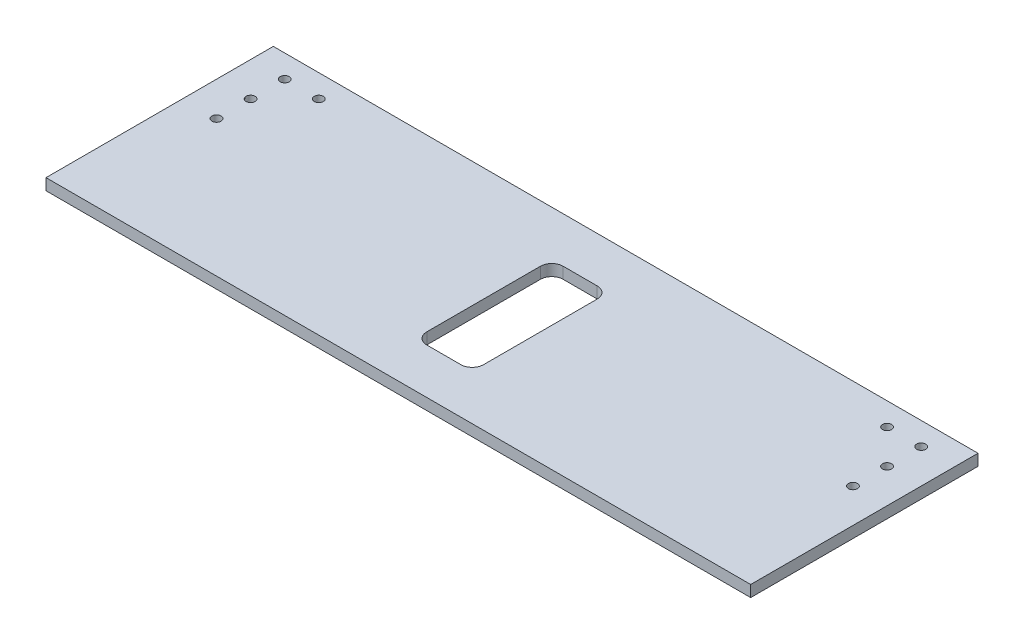
ISO-10303-21;
HEADER;
FILE_DESCRIPTION(('STEP AP214'),'2;1');
FILE_NAME('part.step','',(''),(''),'','','');
FILE_SCHEMA(('AUTOMOTIVE_DESIGN { 1 0 10303 214 1 1 1 1 }'));
ENDSEC;
DATA;
#1=APPLICATION_CONTEXT('core data for automotive mechanical design processes');
#2=APPLICATION_PROTOCOL_DEFINITION('international standard','automotive_design',2000,#1);
#3=PRODUCT_CONTEXT('',#1,'mechanical');
#4=PRODUCT('Part','Part','',(#3));
#5=PRODUCT_RELATED_PRODUCT_CATEGORY('part','',(#4));
#6=PRODUCT_DEFINITION_FORMATION('','',#4);
#7=PRODUCT_DEFINITION_CONTEXT('part definition',#1,'design');
#8=PRODUCT_DEFINITION('design','',#6,#7);
#9=PRODUCT_DEFINITION_SHAPE('','',#8);
#10=(LENGTH_UNIT() NAMED_UNIT(*) SI_UNIT(.MILLI.,.METRE.));
#11=(NAMED_UNIT(*) PLANE_ANGLE_UNIT() SI_UNIT($,.RADIAN.));
#12=(NAMED_UNIT(*) SI_UNIT($,.STERADIAN.) SOLID_ANGLE_UNIT());
#13=UNCERTAINTY_MEASURE_WITH_UNIT(LENGTH_MEASURE(1.E-05),#10,'distance_accuracy_value','');
#14=(GEOMETRIC_REPRESENTATION_CONTEXT(3) GLOBAL_UNCERTAINTY_ASSIGNED_CONTEXT((#13)) GLOBAL_UNIT_ASSIGNED_CONTEXT((#10,
#11,#12)) REPRESENTATION_CONTEXT('',''));
#15=CARTESIAN_POINT('',(0.,0.,0.));
#16=DIRECTION('',(0.,0.,1.));
#17=DIRECTION('',(1.,0.,0.));
#18=AXIS2_PLACEMENT_3D('',#15,#16,#17);
#19=CARTESIAN_POINT('',(-155.,5.,0.));
#20=DIRECTION('',(1.,0.,0.));
#21=DIRECTION('',(0.,0.,-1.));
#22=AXIS2_PLACEMENT_3D('',#19,#20,#21);
#23=PLANE('',#22);
#24=DIRECTION('',(0.,0.,1.));
#25=VECTOR('',#24,1.);
#26=CARTESIAN_POINT('',(-155.,5.,0.));
#27=LINE('',#26,#25);
#28=CARTESIAN_POINT('',(-155.,5.,-50.));
#29=VERTEX_POINT('',#28);
#30=CARTESIAN_POINT('',(-155.,5.,50.));
#31=VERTEX_POINT('',#30);
#32=EDGE_CURVE('E150',#29,#31,#27,.T.);
#33=ORIENTED_EDGE('',*,*,#32,.F.);
#34=DIRECTION('',(0.,1.,0.));
#35=VECTOR('',#34,1.);
#36=CARTESIAN_POINT('',(-155.,0.,-50.));
#37=LINE('',#36,#35);
#38=CARTESIAN_POINT('',(-155.,0.,-50.));
#39=VERTEX_POINT('',#38);
#40=EDGE_CURVE('E136',#39,#29,#37,.T.);
#41=ORIENTED_EDGE('',*,*,#40,.F.);
#42=DIRECTION('',(0.,0.,1.));
#43=VECTOR('',#42,1.);
#44=CARTESIAN_POINT('',(-155.,0.,0.));
#45=LINE('',#44,#43);
#46=CARTESIAN_POINT('',(-155.,0.,50.));
#47=VERTEX_POINT('',#46);
#48=EDGE_CURVE('E148',#39,#47,#45,.T.);
#49=ORIENTED_EDGE('',*,*,#48,.T.);
#50=DIRECTION('',(0.,-1.,0.));
#51=VECTOR('',#50,1.);
#52=CARTESIAN_POINT('',(-155.,5.,50.));
#53=LINE('',#52,#51);
#54=EDGE_CURVE('E172',#31,#47,#53,.T.);
#55=ORIENTED_EDGE('',*,*,#54,.F.);
#56=EDGE_LOOP('',(#33,#41,#49,#55));
#57=FACE_BOUND('',#56,.T.);
#58=ADVANCED_FACE('F43',(#57),#23,.F.);
#59=CARTESIAN_POINT('',(0.,5.,50.));
#60=DIRECTION('',(0.,0.,-1.));
#61=DIRECTION('',(-1.,0.,0.));
#62=AXIS2_PLACEMENT_3D('',#59,#60,#61);
#63=PLANE('',#62);
#64=DIRECTION('',(1.,0.,0.));
#65=VECTOR('',#64,1.);
#66=CARTESIAN_POINT('',(0.,0.,50.));
#67=LINE('',#66,#65);
#68=CARTESIAN_POINT('',(155.,0.,50.));
#69=VERTEX_POINT('',#68);
#70=EDGE_CURVE('E156',#47,#69,#67,.T.);
#71=ORIENTED_EDGE('',*,*,#70,.T.);
#72=DIRECTION('',(0.,-1.,0.));
#73=VECTOR('',#72,1.);
#74=CARTESIAN_POINT('',(155.,5.,50.));
#75=LINE('',#74,#73);
#76=CARTESIAN_POINT('',(155.,5.,50.));
#77=VERTEX_POINT('',#76);
#78=EDGE_CURVE('E169',#77,#69,#75,.T.);
#79=ORIENTED_EDGE('',*,*,#78,.F.);
#80=DIRECTION('',(1.,0.,0.));
#81=VECTOR('',#80,1.);
#82=CARTESIAN_POINT('',(0.,5.,50.));
#83=LINE('',#82,#81);
#84=EDGE_CURVE('E259',#31,#77,#83,.T.);
#85=ORIENTED_EDGE('',*,*,#84,.F.);
#86=ORIENTED_EDGE('',*,*,#54,.T.);
#87=EDGE_LOOP('',(#71,#79,#85,#86));
#88=FACE_BOUND('',#87,.T.);
#89=ADVANCED_FACE('F396',(#88),#63,.F.);
#90=CARTESIAN_POINT('',(155.,5.,0.));
#91=DIRECTION('',(1.,0.,0.));
#92=DIRECTION('',(0.,0.,-1.));
#93=AXIS2_PLACEMENT_3D('',#90,#91,#92);
#94=PLANE('',#93);
#95=DIRECTION('',(0.,1.,0.));
#96=VECTOR('',#95,1.);
#97=CARTESIAN_POINT('',(155.,0.,-50.));
#98=LINE('',#97,#96);
#99=CARTESIAN_POINT('',(155.,0.,-50.));
#100=VERTEX_POINT('',#99);
#101=CARTESIAN_POINT('',(155.,5.,-50.));
#102=VERTEX_POINT('',#101);
#103=EDGE_CURVE('E139',#100,#102,#98,.T.);
#104=ORIENTED_EDGE('',*,*,#103,.T.);
#105=DIRECTION('',(0.,0.,1.));
#106=VECTOR('',#105,1.);
#107=CARTESIAN_POINT('',(155.,5.,0.));
#108=LINE('',#107,#106);
#109=EDGE_CURVE('E164',#102,#77,#108,.T.);
#110=ORIENTED_EDGE('',*,*,#109,.T.);
#111=ORIENTED_EDGE('',*,*,#78,.T.);
#112=DIRECTION('',(0.,0.,1.));
#113=VECTOR('',#112,1.);
#114=CARTESIAN_POINT('',(155.,0.,0.));
#115=LINE('',#114,#113);
#116=EDGE_CURVE('E159',#100,#69,#115,.T.);
#117=ORIENTED_EDGE('',*,*,#116,.F.);
#118=EDGE_LOOP('',(#104,#110,#111,#117));
#119=FACE_BOUND('',#118,.T.);
#120=ADVANCED_FACE('F365',(#119),#94,.T.);
#121=CARTESIAN_POINT('',(0.,5.,0.));
#122=DIRECTION('',(0.,1.,0.));
#123=DIRECTION('',(0.,0.,1.));
#124=AXIS2_PLACEMENT_3D('',#121,#122,#123);
#125=PLANE('',#124);
#126=DIRECTION('',(1.,0.,0.));
#127=VECTOR('',#126,1.);
#128=CARTESIAN_POINT('',(-40.,5.,-50.));
#129=LINE('',#128,#127);
#130=EDGE_CURVE('E144',#29,#102,#129,.T.);
#131=ORIENTED_EDGE('',*,*,#130,.F.);
#132=ORIENTED_EDGE('',*,*,#32,.T.);
#133=ORIENTED_EDGE('',*,*,#84,.T.);
#134=ORIENTED_EDGE('',*,*,#109,.F.);
#135=EDGE_LOOP('',(#131,#132,#133,#134));
#136=FACE_BOUND('',#135,.T.);
#137=CARTESIAN_POINT('',(140.,5.,-40.));
#138=DIRECTION('',(0.,1.,0.));
#139=DIRECTION('',(0.,0.,-1.));
#140=AXIS2_PLACEMENT_3D('',#137,#138,#139);
#141=CIRCLE('',#140,2.);
#142=CARTESIAN_POINT('',(140.,5.,-42.));
#143=VERTEX_POINT('',#142);
#144=EDGE_CURVE('E143',#143,#143,#141,.T.);
#145=ORIENTED_EDGE('',*,*,#144,.F.);
#146=EDGE_LOOP('',(#145));
#147=FACE_BOUND('',#146,.T.);
#148=CARTESIAN_POINT('',(125.,5.,-40.));
#149=DIRECTION('',(0.,1.,0.));
#150=DIRECTION('',(0.,0.,-1.));
#151=AXIS2_PLACEMENT_3D('',#148,#149,#150);
#152=CIRCLE('',#151,2.);
#153=CARTESIAN_POINT('',(125.,5.,-42.));
#154=VERTEX_POINT('',#153);
#155=EDGE_CURVE('E321',#154,#154,#152,.T.);
#156=ORIENTED_EDGE('',*,*,#155,.F.);
#157=EDGE_LOOP('',(#156));
#158=FACE_BOUND('',#157,.T.);
#159=CARTESIAN_POINT('',(140.,5.,-25.));
#160=DIRECTION('',(0.,1.,0.));
#161=DIRECTION('',(0.,0.,-1.));
#162=AXIS2_PLACEMENT_3D('',#159,#160,#161);
#163=CIRCLE('',#162,2.);
#164=CARTESIAN_POINT('',(140.,5.,-27.));
#165=VERTEX_POINT('',#164);
#166=EDGE_CURVE('E316',#165,#165,#163,.T.);
#167=ORIENTED_EDGE('',*,*,#166,.F.);
#168=EDGE_LOOP('',(#167));
#169=FACE_BOUND('',#168,.T.);
#170=CARTESIAN_POINT('',(140.,5.,-10.));
#171=DIRECTION('',(0.,1.,0.));
#172=DIRECTION('',(0.,0.,-1.));
#173=AXIS2_PLACEMENT_3D('',#170,#171,#172);
#174=CIRCLE('',#173,2.);
#175=CARTESIAN_POINT('',(140.,5.,-12.));
#176=VERTEX_POINT('',#175);
#177=EDGE_CURVE('E311',#176,#176,#174,.T.);
#178=ORIENTED_EDGE('',*,*,#177,.F.);
#179=EDGE_LOOP('',(#178));
#180=FACE_BOUND('',#179,.T.);
#181=CARTESIAN_POINT('',(-140.,5.,-10.));
#182=DIRECTION('',(0.,1.,0.));
#183=DIRECTION('',(0.,0.,1.));
#184=AXIS2_PLACEMENT_3D('',#181,#182,#183);
#185=CIRCLE('',#184,2.);
#186=CARTESIAN_POINT('',(-140.,5.,-8.00000000000001));
#187=VERTEX_POINT('',#186);
#188=EDGE_CURVE('E306',#187,#187,#185,.T.);
#189=ORIENTED_EDGE('',*,*,#188,.F.);
#190=EDGE_LOOP('',(#189));
#191=FACE_BOUND('',#190,.T.);
#192=CARTESIAN_POINT('',(-140.,5.,-25.));
#193=DIRECTION('',(0.,1.,0.));
#194=DIRECTION('',(0.,0.,1.));
#195=AXIS2_PLACEMENT_3D('',#192,#193,#194);
#196=CIRCLE('',#195,2.);
#197=CARTESIAN_POINT('',(-140.,5.,-23.));
#198=VERTEX_POINT('',#197);
#199=EDGE_CURVE('E301',#198,#198,#196,.T.);
#200=ORIENTED_EDGE('',*,*,#199,.F.);
#201=EDGE_LOOP('',(#200));
#202=FACE_BOUND('',#201,.T.);
#203=CARTESIAN_POINT('',(-125.,5.,-40.));
#204=DIRECTION('',(0.,1.,0.));
#205=DIRECTION('',(0.,0.,1.));
#206=AXIS2_PLACEMENT_3D('',#203,#204,#205);
#207=CIRCLE('',#206,2.);
#208=CARTESIAN_POINT('',(-125.,5.,-38.));
#209=VERTEX_POINT('',#208);
#210=EDGE_CURVE('E296',#209,#209,#207,.T.);
#211=ORIENTED_EDGE('',*,*,#210,.F.);
#212=EDGE_LOOP('',(#211));
#213=FACE_BOUND('',#212,.T.);
#214=CARTESIAN_POINT('',(-140.,5.,-40.));
#215=DIRECTION('',(0.,1.,0.));
#216=DIRECTION('',(0.,0.,1.));
#217=AXIS2_PLACEMENT_3D('',#214,#215,#216);
#218=CIRCLE('',#217,2.);
#219=CARTESIAN_POINT('',(-140.,5.,-38.));
#220=VERTEX_POINT('',#219);
#221=EDGE_CURVE('E292',#220,#220,#218,.T.);
#222=ORIENTED_EDGE('',*,*,#221,.F.);
#223=EDGE_LOOP('',(#222));
#224=FACE_BOUND('',#223,.T.);
#225=DIRECTION('',(0.,0.,-1.));
#226=VECTOR('',#225,1.);
#227=CARTESIAN_POINT('',(12.5,5.,30.));
#228=LINE('',#227,#226);
#229=CARTESIAN_POINT('',(12.5,5.,25.));
#230=VERTEX_POINT('',#229);
#231=CARTESIAN_POINT('',(12.5,5.,-25.));
#232=VERTEX_POINT('',#231);
#233=EDGE_CURVE('E226',#230,#232,#228,.T.);
#234=ORIENTED_EDGE('',*,*,#233,.F.);
#235=CARTESIAN_POINT('',(7.5,5.,25.));
#236=DIRECTION('',(0.,1.,0.));
#237=DIRECTION('',(0.,0.,1.));
#238=AXIS2_PLACEMENT_3D('',#235,#236,#237);
#239=CIRCLE('',#238,5.);
#240=CARTESIAN_POINT('',(7.5,5.,30.));
#241=VERTEX_POINT('',#240);
#242=EDGE_CURVE('E203',#230,#241,#239,.F.);
#243=ORIENTED_EDGE('',*,*,#242,.T.);
#244=DIRECTION('',(1.,0.,0.));
#245=VECTOR('',#244,1.);
#246=CARTESIAN_POINT('',(-12.5,5.,30.));
#247=LINE('',#246,#245);
#248=CARTESIAN_POINT('',(-7.5,5.,30.));
#249=VERTEX_POINT('',#248);
#250=EDGE_CURVE('E251',#249,#241,#247,.T.);
#251=ORIENTED_EDGE('',*,*,#250,.F.);
#252=CARTESIAN_POINT('',(-7.5,5.,25.));
#253=DIRECTION('',(0.,1.,0.));
#254=DIRECTION('',(0.,0.,1.));
#255=AXIS2_PLACEMENT_3D('',#252,#253,#254);
#256=CIRCLE('',#255,5.);
#257=CARTESIAN_POINT('',(-12.5,5.,25.));
#258=VERTEX_POINT('',#257);
#259=EDGE_CURVE('E193',#249,#258,#256,.F.);
#260=ORIENTED_EDGE('',*,*,#259,.T.);
#261=DIRECTION('',(0.,0.,1.));
#262=VECTOR('',#261,1.);
#263=CARTESIAN_POINT('',(-12.5,5.,30.));
#264=LINE('',#263,#262);
#265=CARTESIAN_POINT('',(-12.5,5.,-25.));
#266=VERTEX_POINT('',#265);
#267=EDGE_CURVE('E217',#266,#258,#264,.T.);
#268=ORIENTED_EDGE('',*,*,#267,.F.);
#269=CARTESIAN_POINT('',(-7.5,5.,-25.));
#270=DIRECTION('',(0.,1.,0.));
#271=DIRECTION('',(0.,0.,1.));
#272=AXIS2_PLACEMENT_3D('',#269,#270,#271);
#273=CIRCLE('',#272,5.);
#274=CARTESIAN_POINT('',(-7.5,5.,-30.));
#275=VERTEX_POINT('',#274);
#276=EDGE_CURVE('E51',#266,#275,#273,.F.);
#277=ORIENTED_EDGE('',*,*,#276,.T.);
#278=DIRECTION('',(-1.,0.,0.));
#279=VECTOR('',#278,1.);
#280=CARTESIAN_POINT('',(-12.5,5.,-30.));
#281=LINE('',#280,#279);
#282=CARTESIAN_POINT('',(7.5,5.,-30.));
#283=VERTEX_POINT('',#282);
#284=EDGE_CURVE('E215',#283,#275,#281,.T.);
#285=ORIENTED_EDGE('',*,*,#284,.F.);
#286=CARTESIAN_POINT('',(7.5,5.,-25.));
#287=DIRECTION('',(0.,1.,0.));
#288=DIRECTION('',(0.,0.,1.));
#289=AXIS2_PLACEMENT_3D('',#286,#287,#288);
#290=CIRCLE('',#289,5.);
#291=EDGE_CURVE('E198',#283,#232,#290,.F.);
#292=ORIENTED_EDGE('',*,*,#291,.T.);
#293=EDGE_LOOP('',(#234,#243,#251,#260,#268,#277,#285,#292));
#294=FACE_BOUND('',#293,.T.);
#295=ADVANCED_FACE('F214',(#136,#147,#158,#169,#180,#191,#202,#213,#224,#294),#125,.T.);
#296=CARTESIAN_POINT('',(0.,0.,0.));
#297=DIRECTION('',(0.,1.,0.));
#298=DIRECTION('',(0.,0.,1.));
#299=AXIS2_PLACEMENT_3D('',#296,#297,#298);
#300=PLANE('',#299);
#301=ORIENTED_EDGE('',*,*,#48,.F.);
#302=DIRECTION('',(1.,0.,0.));
#303=VECTOR('',#302,1.);
#304=CARTESIAN_POINT('',(-40.,0.,-50.));
#305=LINE('',#304,#303);
#306=EDGE_CURVE('E133',#39,#100,#305,.T.);
#307=ORIENTED_EDGE('',*,*,#306,.T.);
#308=ORIENTED_EDGE('',*,*,#116,.T.);
#309=ORIENTED_EDGE('',*,*,#70,.F.);
#310=EDGE_LOOP('',(#301,#307,#308,#309));
#311=FACE_BOUND('',#310,.T.);
#312=CARTESIAN_POINT('',(140.,0.,-40.));
#313=DIRECTION('',(0.,1.,0.));
#314=DIRECTION('',(0.,0.,-1.));
#315=AXIS2_PLACEMENT_3D('',#312,#313,#314);
#316=CIRCLE('',#315,2.);
#317=CARTESIAN_POINT('',(140.,0.,-42.));
#318=VERTEX_POINT('',#317);
#319=EDGE_CURVE('E275',#318,#318,#316,.T.);
#320=ORIENTED_EDGE('',*,*,#319,.T.);
#321=EDGE_LOOP('',(#320));
#322=FACE_BOUND('',#321,.T.);
#323=CARTESIAN_POINT('',(125.,0.,-40.));
#324=DIRECTION('',(0.,1.,0.));
#325=DIRECTION('',(0.,0.,-1.));
#326=AXIS2_PLACEMENT_3D('',#323,#324,#325);
#327=CIRCLE('',#326,2.);
#328=CARTESIAN_POINT('',(125.,0.,-42.));
#329=VERTEX_POINT('',#328);
#330=EDGE_CURVE('E319',#329,#329,#327,.T.);
#331=ORIENTED_EDGE('',*,*,#330,.T.);
#332=EDGE_LOOP('',(#331));
#333=FACE_BOUND('',#332,.T.);
#334=CARTESIAN_POINT('',(140.,0.,-25.));
#335=DIRECTION('',(0.,1.,0.));
#336=DIRECTION('',(0.,0.,-1.));
#337=AXIS2_PLACEMENT_3D('',#334,#335,#336);
#338=CIRCLE('',#337,2.);
#339=CARTESIAN_POINT('',(140.,0.,-27.));
#340=VERTEX_POINT('',#339);
#341=EDGE_CURVE('E314',#340,#340,#338,.T.);
#342=ORIENTED_EDGE('',*,*,#341,.T.);
#343=EDGE_LOOP('',(#342));
#344=FACE_BOUND('',#343,.T.);
#345=CARTESIAN_POINT('',(140.,0.,-10.));
#346=DIRECTION('',(0.,1.,0.));
#347=DIRECTION('',(0.,0.,-1.));
#348=AXIS2_PLACEMENT_3D('',#345,#346,#347);
#349=CIRCLE('',#348,2.);
#350=CARTESIAN_POINT('',(140.,0.,-12.));
#351=VERTEX_POINT('',#350);
#352=EDGE_CURVE('E309',#351,#351,#349,.T.);
#353=ORIENTED_EDGE('',*,*,#352,.T.);
#354=EDGE_LOOP('',(#353));
#355=FACE_BOUND('',#354,.T.);
#356=CARTESIAN_POINT('',(-140.,0.,-10.));
#357=DIRECTION('',(0.,1.,0.));
#358=DIRECTION('',(0.,0.,1.));
#359=AXIS2_PLACEMENT_3D('',#356,#357,#358);
#360=CIRCLE('',#359,2.);
#361=CARTESIAN_POINT('',(-140.,0.,-8.00000000000001));
#362=VERTEX_POINT('',#361);
#363=EDGE_CURVE('E304',#362,#362,#360,.T.);
#364=ORIENTED_EDGE('',*,*,#363,.T.);
#365=EDGE_LOOP('',(#364));
#366=FACE_BOUND('',#365,.T.);
#367=CARTESIAN_POINT('',(-140.,0.,-25.));
#368=DIRECTION('',(0.,1.,0.));
#369=DIRECTION('',(0.,0.,1.));
#370=AXIS2_PLACEMENT_3D('',#367,#368,#369);
#371=CIRCLE('',#370,2.);
#372=CARTESIAN_POINT('',(-140.,0.,-23.));
#373=VERTEX_POINT('',#372);
#374=EDGE_CURVE('E299',#373,#373,#371,.T.);
#375=ORIENTED_EDGE('',*,*,#374,.T.);
#376=EDGE_LOOP('',(#375));
#377=FACE_BOUND('',#376,.T.);
#378=CARTESIAN_POINT('',(-125.,0.,-40.));
#379=DIRECTION('',(0.,1.,0.));
#380=DIRECTION('',(0.,0.,1.));
#381=AXIS2_PLACEMENT_3D('',#378,#379,#380);
#382=CIRCLE('',#381,2.);
#383=CARTESIAN_POINT('',(-125.,0.,-38.));
#384=VERTEX_POINT('',#383);
#385=EDGE_CURVE('E295',#384,#384,#382,.T.);
#386=ORIENTED_EDGE('',*,*,#385,.T.);
#387=EDGE_LOOP('',(#386));
#388=FACE_BOUND('',#387,.T.);
#389=CARTESIAN_POINT('',(-140.,0.,-40.));
#390=DIRECTION('',(0.,1.,0.));
#391=DIRECTION('',(0.,0.,1.));
#392=AXIS2_PLACEMENT_3D('',#389,#390,#391);
#393=CIRCLE('',#392,2.);
#394=CARTESIAN_POINT('',(-140.,0.,-38.));
#395=VERTEX_POINT('',#394);
#396=EDGE_CURVE('E242',#395,#395,#393,.T.);
#397=ORIENTED_EDGE('',*,*,#396,.T.);
#398=EDGE_LOOP('',(#397));
#399=FACE_BOUND('',#398,.T.);
#400=DIRECTION('',(0.,0.,1.));
#401=VECTOR('',#400,1.);
#402=CARTESIAN_POINT('',(-12.5,0.,30.));
#403=LINE('',#402,#401);
#404=CARTESIAN_POINT('',(-12.5,0.,-25.));
#405=VERTEX_POINT('',#404);
#406=CARTESIAN_POINT('',(-12.5,0.,25.));
#407=VERTEX_POINT('',#406);
#408=EDGE_CURVE('E161',#405,#407,#403,.T.);
#409=ORIENTED_EDGE('',*,*,#408,.T.);
#410=CARTESIAN_POINT('',(-7.5,0.,25.));
#411=DIRECTION('',(0.,1.,0.));
#412=DIRECTION('',(0.,0.,1.));
#413=AXIS2_PLACEMENT_3D('',#410,#411,#412);
#414=CIRCLE('',#413,5.);
#415=CARTESIAN_POINT('',(-7.5,0.,30.));
#416=VERTEX_POINT('',#415);
#417=EDGE_CURVE('E196',#407,#416,#414,.T.);
#418=ORIENTED_EDGE('',*,*,#417,.T.);
#419=DIRECTION('',(1.,0.,0.));
#420=VECTOR('',#419,1.);
#421=CARTESIAN_POINT('',(-12.5,0.,30.));
#422=LINE('',#421,#420);
#423=CARTESIAN_POINT('',(7.5,0.,30.));
#424=VERTEX_POINT('',#423);
#425=EDGE_CURVE('E157',#416,#424,#422,.T.);
#426=ORIENTED_EDGE('',*,*,#425,.T.);
#427=CARTESIAN_POINT('',(7.5,0.,25.));
#428=DIRECTION('',(0.,1.,0.));
#429=DIRECTION('',(0.,0.,1.));
#430=AXIS2_PLACEMENT_3D('',#427,#428,#429);
#431=CIRCLE('',#430,5.);
#432=CARTESIAN_POINT('',(12.5,0.,25.));
#433=VERTEX_POINT('',#432);
#434=EDGE_CURVE('E65',#424,#433,#431,.T.);
#435=ORIENTED_EDGE('',*,*,#434,.T.);
#436=DIRECTION('',(0.,0.,-1.));
#437=VECTOR('',#436,1.);
#438=CARTESIAN_POINT('',(12.5,0.,30.));
#439=LINE('',#438,#437);
#440=CARTESIAN_POINT('',(12.5,0.,-25.));
#441=VERTEX_POINT('',#440);
#442=EDGE_CURVE('E236',#433,#441,#439,.T.);
#443=ORIENTED_EDGE('',*,*,#442,.T.);
#444=CARTESIAN_POINT('',(7.5,0.,-25.));
#445=DIRECTION('',(0.,1.,0.));
#446=DIRECTION('',(0.,0.,1.));
#447=AXIS2_PLACEMENT_3D('',#444,#445,#446);
#448=CIRCLE('',#447,5.);
#449=CARTESIAN_POINT('',(7.5,0.,-30.));
#450=VERTEX_POINT('',#449);
#451=EDGE_CURVE('E201',#441,#450,#448,.T.);
#452=ORIENTED_EDGE('',*,*,#451,.T.);
#453=DIRECTION('',(-1.,0.,0.));
#454=VECTOR('',#453,1.);
#455=CARTESIAN_POINT('',(-12.5,0.,-30.));
#456=LINE('',#455,#454);
#457=CARTESIAN_POINT('',(-7.5,0.,-30.));
#458=VERTEX_POINT('',#457);
#459=EDGE_CURVE('E231',#450,#458,#456,.T.);
#460=ORIENTED_EDGE('',*,*,#459,.T.);
#461=CARTESIAN_POINT('',(-7.5,0.,-25.));
#462=DIRECTION('',(0.,1.,0.));
#463=DIRECTION('',(0.,0.,1.));
#464=AXIS2_PLACEMENT_3D('',#461,#462,#463);
#465=CIRCLE('',#464,5.);
#466=EDGE_CURVE('E12',#458,#405,#465,.T.);
#467=ORIENTED_EDGE('',*,*,#466,.T.);
#468=EDGE_LOOP('',(#409,#418,#426,#435,#443,#452,#460,#467));
#469=FACE_BOUND('',#468,.T.);
#470=ADVANCED_FACE('F153',(#311,#322,#333,#344,#355,#366,#377,#388,#399,#469),#300,.F.);
#471=CARTESIAN_POINT('',(12.5,0.,30.));
#472=DIRECTION('',(1.,0.,0.));
#473=DIRECTION('',(0.,0.,-1.));
#474=AXIS2_PLACEMENT_3D('',#471,#472,#473);
#475=PLANE('',#474);
#476=ORIENTED_EDGE('',*,*,#233,.T.);
#477=DIRECTION('',(0.,1.,0.));
#478=VECTOR('',#477,1.);
#479=CARTESIAN_POINT('',(12.5,0.,-25.));
#480=LINE('',#479,#478);
#481=EDGE_CURVE('E58',#232,#441,#480,.F.);
#482=ORIENTED_EDGE('',*,*,#481,.T.);
#483=ORIENTED_EDGE('',*,*,#442,.F.);
#484=DIRECTION('',(0.,1.,0.));
#485=VECTOR('',#484,1.);
#486=CARTESIAN_POINT('',(12.5,5.,25.));
#487=LINE('',#486,#485);
#488=EDGE_CURVE('E189',#433,#230,#487,.T.);
#489=ORIENTED_EDGE('',*,*,#488,.T.);
#490=EDGE_LOOP('',(#476,#482,#483,#489));
#491=FACE_BOUND('',#490,.T.);
#492=ADVANCED_FACE('F280',(#491),#475,.F.);
#493=CARTESIAN_POINT('',(-12.5,0.,30.));
#494=DIRECTION('',(0.,0.,1.));
#495=DIRECTION('',(1.,0.,0.));
#496=AXIS2_PLACEMENT_3D('',#493,#494,#495);
#497=PLANE('',#496);
#498=ORIENTED_EDGE('',*,*,#425,.F.);
#499=DIRECTION('',(0.,1.,0.));
#500=VECTOR('',#499,1.);
#501=CARTESIAN_POINT('',(-7.5,5.,30.));
#502=LINE('',#501,#500);
#503=EDGE_CURVE('E176',#416,#249,#502,.T.);
#504=ORIENTED_EDGE('',*,*,#503,.T.);
#505=ORIENTED_EDGE('',*,*,#250,.T.);
#506=DIRECTION('',(0.,1.,0.));
#507=VECTOR('',#506,1.);
#508=CARTESIAN_POINT('',(7.5,0.,30.));
#509=LINE('',#508,#507);
#510=EDGE_CURVE('E174',#241,#424,#509,.F.);
#511=ORIENTED_EDGE('',*,*,#510,.T.);
#512=EDGE_LOOP('',(#498,#504,#505,#511));
#513=FACE_BOUND('',#512,.T.);
#514=ADVANCED_FACE('F287',(#513),#497,.F.);
#515=CARTESIAN_POINT('',(-12.5,0.,30.));
#516=DIRECTION('',(-1.,0.,0.));
#517=DIRECTION('',(0.,0.,1.));
#518=AXIS2_PLACEMENT_3D('',#515,#516,#517);
#519=PLANE('',#518);
#520=ORIENTED_EDGE('',*,*,#267,.T.);
#521=DIRECTION('',(0.,1.,0.));
#522=VECTOR('',#521,1.);
#523=CARTESIAN_POINT('',(-12.5,0.,25.));
#524=LINE('',#523,#522);
#525=EDGE_CURVE('E182',#258,#407,#524,.F.);
#526=ORIENTED_EDGE('',*,*,#525,.T.);
#527=ORIENTED_EDGE('',*,*,#408,.F.);
#528=DIRECTION('',(0.,1.,0.));
#529=VECTOR('',#528,1.);
#530=CARTESIAN_POINT('',(-12.5,5.,-25.));
#531=LINE('',#530,#529);
#532=EDGE_CURVE('E179',#405,#266,#531,.T.);
#533=ORIENTED_EDGE('',*,*,#532,.T.);
#534=EDGE_LOOP('',(#520,#526,#527,#533));
#535=FACE_BOUND('',#534,.T.);
#536=ADVANCED_FACE('F233',(#535),#519,.F.);
#537=CARTESIAN_POINT('',(-12.5,0.,-30.));
#538=DIRECTION('',(0.,0.,-1.));
#539=DIRECTION('',(-1.,0.,0.));
#540=AXIS2_PLACEMENT_3D('',#537,#538,#539);
#541=PLANE('',#540);
#542=ORIENTED_EDGE('',*,*,#459,.F.);
#543=DIRECTION('',(0.,1.,0.));
#544=VECTOR('',#543,1.);
#545=CARTESIAN_POINT('',(7.5,5.,-30.));
#546=LINE('',#545,#544);
#547=EDGE_CURVE('E186',#450,#283,#546,.T.);
#548=ORIENTED_EDGE('',*,*,#547,.T.);
#549=ORIENTED_EDGE('',*,*,#284,.T.);
#550=DIRECTION('',(0.,1.,0.));
#551=VECTOR('',#550,1.);
#552=CARTESIAN_POINT('',(-7.5,0.,-30.));
#553=LINE('',#552,#551);
#554=EDGE_CURVE('E184',#275,#458,#553,.F.);
#555=ORIENTED_EDGE('',*,*,#554,.T.);
#556=EDGE_LOOP('',(#542,#548,#549,#555));
#557=FACE_BOUND('',#556,.T.);
#558=ADVANCED_FACE('F223',(#557),#541,.F.);
#559=CARTESIAN_POINT('',(-140.,0.,-40.));
#560=DIRECTION('',(0.,1.,0.));
#561=DIRECTION('',(0.,0.,1.));
#562=AXIS2_PLACEMENT_3D('',#559,#560,#561);
#563=CYLINDRICAL_SURFACE('',#562,2.);
#564=ORIENTED_EDGE('',*,*,#396,.F.);
#565=EDGE_LOOP('',(#564));
#566=FACE_BOUND('',#565,.T.);
#567=ORIENTED_EDGE('',*,*,#221,.T.);
#568=EDGE_LOOP('',(#567));
#569=FACE_BOUND('',#568,.T.);
#570=ADVANCED_FACE('F380',(#566,#569),#563,.F.);
#571=CARTESIAN_POINT('',(-125.,0.,-40.));
#572=DIRECTION('',(0.,1.,0.));
#573=DIRECTION('',(0.,0.,1.));
#574=AXIS2_PLACEMENT_3D('',#571,#572,#573);
#575=CYLINDRICAL_SURFACE('',#574,2.);
#576=ORIENTED_EDGE('',*,*,#385,.F.);
#577=EDGE_LOOP('',(#576));
#578=FACE_BOUND('',#577,.T.);
#579=ORIENTED_EDGE('',*,*,#210,.T.);
#580=EDGE_LOOP('',(#579));
#581=FACE_BOUND('',#580,.T.);
#582=ADVANCED_FACE('F382',(#578,#581),#575,.F.);
#583=CARTESIAN_POINT('',(-140.,0.,-25.));
#584=DIRECTION('',(0.,1.,0.));
#585=DIRECTION('',(0.,0.,1.));
#586=AXIS2_PLACEMENT_3D('',#583,#584,#585);
#587=CYLINDRICAL_SURFACE('',#586,2.);
#588=ORIENTED_EDGE('',*,*,#374,.F.);
#589=EDGE_LOOP('',(#588));
#590=FACE_BOUND('',#589,.T.);
#591=ORIENTED_EDGE('',*,*,#199,.T.);
#592=EDGE_LOOP('',(#591));
#593=FACE_BOUND('',#592,.T.);
#594=ADVANCED_FACE('F389',(#590,#593),#587,.F.);
#595=CARTESIAN_POINT('',(-140.,0.,-10.));
#596=DIRECTION('',(0.,1.,0.));
#597=DIRECTION('',(0.,0.,1.));
#598=AXIS2_PLACEMENT_3D('',#595,#596,#597);
#599=CYLINDRICAL_SURFACE('',#598,2.);
#600=ORIENTED_EDGE('',*,*,#363,.F.);
#601=EDGE_LOOP('',(#600));
#602=FACE_BOUND('',#601,.T.);
#603=ORIENTED_EDGE('',*,*,#188,.T.);
#604=EDGE_LOOP('',(#603));
#605=FACE_BOUND('',#604,.T.);
#606=ADVANCED_FACE('F534',(#602,#605),#599,.F.);
#607=CARTESIAN_POINT('',(140.,0.,-10.));
#608=DIRECTION('',(0.,1.,0.));
#609=DIRECTION('',(0.,0.,1.));
#610=AXIS2_PLACEMENT_3D('',#607,#608,#609);
#611=CYLINDRICAL_SURFACE('',#610,2.);
#612=ORIENTED_EDGE('',*,*,#352,.F.);
#613=EDGE_LOOP('',(#612));
#614=FACE_BOUND('',#613,.T.);
#615=ORIENTED_EDGE('',*,*,#177,.T.);
#616=EDGE_LOOP('',(#615));
#617=FACE_BOUND('',#616,.T.);
#618=ADVANCED_FACE('F524',(#614,#617),#611,.F.);
#619=CARTESIAN_POINT('',(140.,0.,-25.));
#620=DIRECTION('',(0.,1.,0.));
#621=DIRECTION('',(0.,0.,1.));
#622=AXIS2_PLACEMENT_3D('',#619,#620,#621);
#623=CYLINDRICAL_SURFACE('',#622,2.);
#624=ORIENTED_EDGE('',*,*,#341,.F.);
#625=EDGE_LOOP('',(#624));
#626=FACE_BOUND('',#625,.T.);
#627=ORIENTED_EDGE('',*,*,#166,.T.);
#628=EDGE_LOOP('',(#627));
#629=FACE_BOUND('',#628,.T.);
#630=ADVANCED_FACE('F359',(#626,#629),#623,.F.);
#631=CARTESIAN_POINT('',(125.,0.,-40.));
#632=DIRECTION('',(0.,1.,0.));
#633=DIRECTION('',(0.,0.,1.));
#634=AXIS2_PLACEMENT_3D('',#631,#632,#633);
#635=CYLINDRICAL_SURFACE('',#634,2.);
#636=ORIENTED_EDGE('',*,*,#330,.F.);
#637=EDGE_LOOP('',(#636));
#638=FACE_BOUND('',#637,.T.);
#639=ORIENTED_EDGE('',*,*,#155,.T.);
#640=EDGE_LOOP('',(#639));
#641=FACE_BOUND('',#640,.T.);
#642=ADVANCED_FACE('F355',(#638,#641),#635,.F.);
#643=CARTESIAN_POINT('',(140.,0.,-40.));
#644=DIRECTION('',(0.,1.,0.));
#645=DIRECTION('',(0.,0.,1.));
#646=AXIS2_PLACEMENT_3D('',#643,#644,#645);
#647=CYLINDRICAL_SURFACE('',#646,2.);
#648=ORIENTED_EDGE('',*,*,#319,.F.);
#649=EDGE_LOOP('',(#648));
#650=FACE_BOUND('',#649,.T.);
#651=ORIENTED_EDGE('',*,*,#144,.T.);
#652=EDGE_LOOP('',(#651));
#653=FACE_BOUND('',#652,.T.);
#654=ADVANCED_FACE('F358',(#650,#653),#647,.F.);
#655=CARTESIAN_POINT('',(-7.5,0.,25.));
#656=DIRECTION('',(0.,-1.,0.));
#657=DIRECTION('',(0.,0.,-1.));
#658=AXIS2_PLACEMENT_3D('',#655,#656,#657);
#659=CYLINDRICAL_SURFACE('',#658,5.);
#660=ORIENTED_EDGE('',*,*,#417,.F.);
#661=ORIENTED_EDGE('',*,*,#525,.F.);
#662=ORIENTED_EDGE('',*,*,#259,.F.);
#663=ORIENTED_EDGE('',*,*,#503,.F.);
#664=EDGE_LOOP('',(#660,#661,#662,#663));
#665=FACE_BOUND('',#664,.T.);
#666=ADVANCED_FACE('F290',(#665),#659,.F.);
#667=CARTESIAN_POINT('',(7.5,0.,-25.));
#668=DIRECTION('',(0.,-1.,0.));
#669=DIRECTION('',(0.,0.,-1.));
#670=AXIS2_PLACEMENT_3D('',#667,#668,#669);
#671=CYLINDRICAL_SURFACE('',#670,5.);
#672=ORIENTED_EDGE('',*,*,#451,.F.);
#673=ORIENTED_EDGE('',*,*,#481,.F.);
#674=ORIENTED_EDGE('',*,*,#291,.F.);
#675=ORIENTED_EDGE('',*,*,#547,.F.);
#676=EDGE_LOOP('',(#672,#673,#674,#675));
#677=FACE_BOUND('',#676,.T.);
#678=ADVANCED_FACE('F279',(#677),#671,.F.);
#679=CARTESIAN_POINT('',(7.5,0.,25.));
#680=DIRECTION('',(0.,-1.,0.));
#681=DIRECTION('',(0.,0.,-1.));
#682=AXIS2_PLACEMENT_3D('',#679,#680,#681);
#683=CYLINDRICAL_SURFACE('',#682,5.);
#684=ORIENTED_EDGE('',*,*,#434,.F.);
#685=ORIENTED_EDGE('',*,*,#510,.F.);
#686=ORIENTED_EDGE('',*,*,#242,.F.);
#687=ORIENTED_EDGE('',*,*,#488,.F.);
#688=EDGE_LOOP('',(#684,#685,#686,#687));
#689=FACE_BOUND('',#688,.T.);
#690=ADVANCED_FACE('F282',(#689),#683,.F.);
#691=CARTESIAN_POINT('',(-7.5,0.,-25.));
#692=DIRECTION('',(0.,-1.,0.));
#693=DIRECTION('',(0.,0.,-1.));
#694=AXIS2_PLACEMENT_3D('',#691,#692,#693);
#695=CYLINDRICAL_SURFACE('',#694,5.);
#696=ORIENTED_EDGE('',*,*,#466,.F.);
#697=ORIENTED_EDGE('',*,*,#554,.F.);
#698=ORIENTED_EDGE('',*,*,#276,.F.);
#699=ORIENTED_EDGE('',*,*,#532,.F.);
#700=EDGE_LOOP('',(#696,#697,#698,#699));
#701=FACE_BOUND('',#700,.T.);
#702=ADVANCED_FACE('F45',(#701),#695,.F.);
#703=CARTESIAN_POINT('',(-40.,0.,-50.));
#704=DIRECTION('',(0.,0.,1.));
#705=DIRECTION('',(1.,0.,0.));
#706=AXIS2_PLACEMENT_3D('',#703,#704,#705);
#707=PLANE('',#706);
#708=ORIENTED_EDGE('',*,*,#306,.F.);
#709=ORIENTED_EDGE('',*,*,#40,.T.);
#710=ORIENTED_EDGE('',*,*,#130,.T.);
#711=ORIENTED_EDGE('',*,*,#103,.F.);
#712=EDGE_LOOP('',(#708,#709,#710,#711));
#713=FACE_BOUND('',#712,.T.);
#714=ADVANCED_FACE('F135',(#713),#707,.F.);
#715=CLOSED_SHELL('',(#58,#89,#120,#295,#470,#492,#514,#536,#558,#570,#582,#594,#606,#618,#630,
#642,#654,#666,#678,#690,#702,#714));
#716=MANIFOLD_SOLID_BREP('B2',#715);
#717=ADVANCED_BREP_SHAPE_REPRESENTATION('',(#18,#716),#14);
#718=SHAPE_DEFINITION_REPRESENTATION(#9,#717);
ENDSEC;
END-ISO-10303-21;
